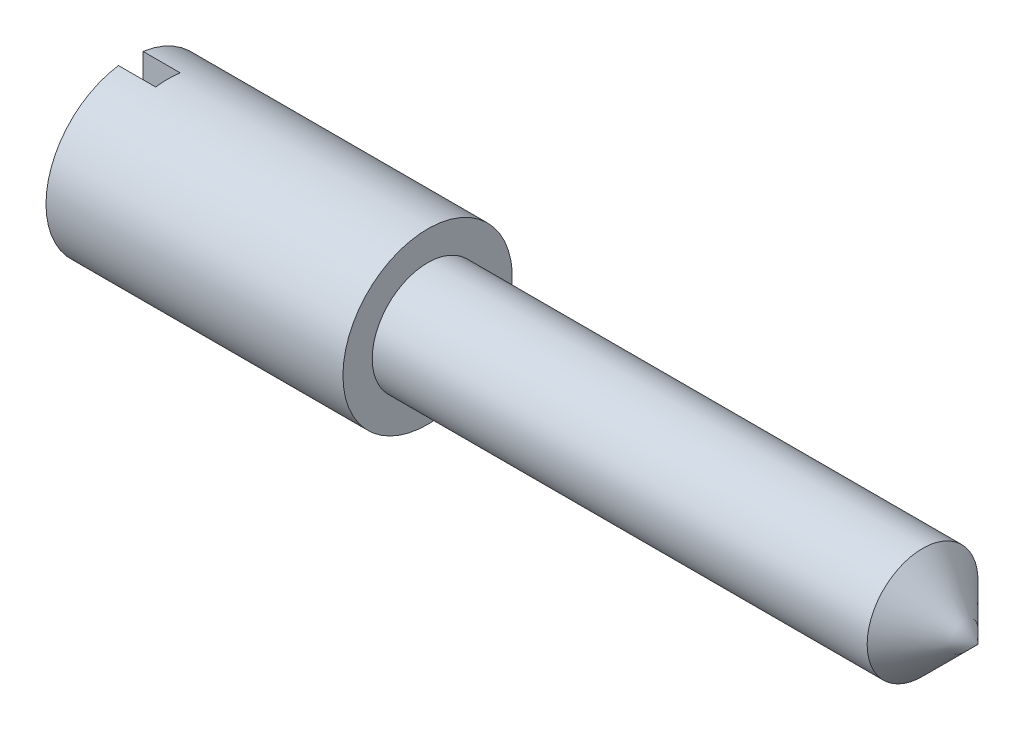
ISO-10303-21;
HEADER;
FILE_DESCRIPTION(('STEP AP214'),'2;1');
FILE_NAME('part.step','',(''),(''),'','','');
FILE_SCHEMA(('AUTOMOTIVE_DESIGN { 1 0 10303 214 1 1 1 1 }'));
ENDSEC;
DATA;
#1=APPLICATION_CONTEXT('core data for automotive mechanical design processes');
#2=APPLICATION_PROTOCOL_DEFINITION('international standard','automotive_design',2000,#1);
#3=PRODUCT_CONTEXT('',#1,'mechanical');
#4=PRODUCT('Part','Part','',(#3));
#5=PRODUCT_RELATED_PRODUCT_CATEGORY('part','',(#4));
#6=PRODUCT_DEFINITION_FORMATION('','',#4);
#7=PRODUCT_DEFINITION_CONTEXT('part definition',#1,'design');
#8=PRODUCT_DEFINITION('design','',#6,#7);
#9=PRODUCT_DEFINITION_SHAPE('','',#8);
#10=(LENGTH_UNIT() NAMED_UNIT(*) SI_UNIT(.MILLI.,.METRE.));
#11=(NAMED_UNIT(*) PLANE_ANGLE_UNIT() SI_UNIT($,.RADIAN.));
#12=(NAMED_UNIT(*) SI_UNIT($,.STERADIAN.) SOLID_ANGLE_UNIT());
#13=UNCERTAINTY_MEASURE_WITH_UNIT(LENGTH_MEASURE(1.E-05),#10,'distance_accuracy_value','');
#14=(GEOMETRIC_REPRESENTATION_CONTEXT(3) GLOBAL_UNCERTAINTY_ASSIGNED_CONTEXT((#13)) GLOBAL_UNIT_ASSIGNED_CONTEXT((#10,
#11,#12)) REPRESENTATION_CONTEXT('',''));
#15=CARTESIAN_POINT('',(0.,0.,0.));
#16=DIRECTION('',(0.,0.,1.));
#17=DIRECTION('',(1.,0.,0.));
#18=AXIS2_PLACEMENT_3D('',#15,#16,#17);
#19=CARTESIAN_POINT('',(-9.525,0.,-0.939799999999999));
#20=DIRECTION('',(1.,0.,0.));
#21=DIRECTION('',(0.,0.,-1.));
#22=AXIS2_PLACEMENT_3D('',#19,#20,#21);
#23=PLANE('',#22);
#24=CARTESIAN_POINT('',(-9.525,0.,1.778));
#25=DIRECTION('',(-1.,0.,0.));
#26=DIRECTION('',(0.,0.,1.));
#27=AXIS2_PLACEMENT_3D('',#24,#25,#26);
#28=CIRCLE('',#27,2.7178);
#29=CARTESIAN_POINT('',(-9.525,2.68913315958879,1.3843));
#30=VERTEX_POINT('',#29);
#31=CARTESIAN_POINT('',(-9.525,-2.68913315958879,1.3843));
#32=VERTEX_POINT('',#31);
#33=EDGE_CURVE('E109',#30,#32,#28,.T.);
#34=ORIENTED_EDGE('',*,*,#33,.T.);
#35=DIRECTION('',(0.,1.,0.));
#36=VECTOR('',#35,1.);
#37=CARTESIAN_POINT('',(-9.525,0.,1.3843));
#38=LINE('',#37,#36);
#39=EDGE_CURVE('E95',#32,#30,#38,.T.);
#40=ORIENTED_EDGE('',*,*,#39,.T.);
#41=EDGE_LOOP('',(#34,#40));
#42=FACE_BOUND('',#41,.T.);
#43=ADVANCED_FACE('F46',(#42),#23,.F.);
#44=CARTESIAN_POINT('',(0.,0.,0.));
#45=DIRECTION('',(-1.,0.,0.));
#46=DIRECTION('',(0.,0.,1.));
#47=AXIS2_PLACEMENT_3D('',#44,#45,#46);
#48=PLANE('',#47);
#49=CARTESIAN_POINT('',(0.,0.,1.778));
#50=DIRECTION('',(-1.,0.,0.));
#51=DIRECTION('',(0.,0.,1.));
#52=AXIS2_PLACEMENT_3D('',#49,#50,#51);
#53=CIRCLE('',#52,2.7178);
#54=CARTESIAN_POINT('',(0.,0.,4.4958));
#55=VERTEX_POINT('',#54);
#56=EDGE_CURVE('E96',#55,#55,#53,.T.);
#57=ORIENTED_EDGE('',*,*,#56,.F.);
#58=EDGE_LOOP('',(#57));
#59=FACE_BOUND('',#58,.T.);
#60=CARTESIAN_POINT('',(0.,0.,1.778));
#61=DIRECTION('',(-1.,0.,0.));
#62=DIRECTION('',(0.,0.,1.));
#63=AXIS2_PLACEMENT_3D('',#60,#61,#62);
#64=CIRCLE('',#63,1.778);
#65=CARTESIAN_POINT('',(0.,0.,3.556));
#66=VERTEX_POINT('',#65);
#67=EDGE_CURVE('E116',#66,#66,#64,.T.);
#68=ORIENTED_EDGE('',*,*,#67,.T.);
#69=EDGE_LOOP('',(#68));
#70=FACE_BOUND('',#69,.T.);
#71=ADVANCED_FACE('F48',(#59,#70),#48,.F.);
#72=CARTESIAN_POINT('',(-9.525,0.,1.778));
#73=DIRECTION('',(-1.,0.,0.));
#74=DIRECTION('',(0.,0.,1.));
#75=AXIS2_PLACEMENT_3D('',#72,#73,#74);
#76=CYLINDRICAL_SURFACE('',#75,2.7178);
#77=ORIENTED_EDGE('',*,*,#33,.F.);
#78=DIRECTION('',(-1.,0.,0.));
#79=VECTOR('',#78,1.);
#80=CARTESIAN_POINT('',(-9.525,2.68913315958879,1.3843));
#81=LINE('',#80,#79);
#82=CARTESIAN_POINT('',(-8.3312,2.68913315958879,1.3843));
#83=VERTEX_POINT('',#82);
#84=EDGE_CURVE('E105',#30,#83,#81,.F.);
#85=ORIENTED_EDGE('',*,*,#84,.T.);
#86=CARTESIAN_POINT('',(-8.3312,0.,1.778));
#87=DIRECTION('',(-1.,0.,0.));
#88=DIRECTION('',(0.,0.,1.));
#89=AXIS2_PLACEMENT_3D('',#86,#87,#88);
#90=CIRCLE('',#89,2.7178);
#91=CARTESIAN_POINT('',(-8.3312,2.68913315958879,2.1717));
#92=VERTEX_POINT('',#91);
#93=EDGE_CURVE('E12',#92,#83,#90,.T.);
#94=ORIENTED_EDGE('',*,*,#93,.F.);
#95=DIRECTION('',(-1.,0.,0.));
#96=VECTOR('',#95,1.);
#97=CARTESIAN_POINT('',(-9.525,2.68913315958879,2.1717));
#98=LINE('',#97,#96);
#99=CARTESIAN_POINT('',(-9.525,2.68913315958879,2.1717));
#100=VERTEX_POINT('',#99);
#101=EDGE_CURVE('E89',#92,#100,#98,.T.);
#102=ORIENTED_EDGE('',*,*,#101,.T.);
#103=CARTESIAN_POINT('',(-9.525,-2.68913315958879,2.1717));
#104=VERTEX_POINT('',#103);
#105=EDGE_CURVE('E102',#104,#100,#28,.T.);
#106=ORIENTED_EDGE('',*,*,#105,.F.);
#107=DIRECTION('',(-1.,0.,0.));
#108=VECTOR('',#107,1.);
#109=CARTESIAN_POINT('',(-9.525,-2.68913315958879,2.1717));
#110=LINE('',#109,#108);
#111=CARTESIAN_POINT('',(-8.3312,-2.68913315958879,2.1717));
#112=VERTEX_POINT('',#111);
#113=EDGE_CURVE('E62',#104,#112,#110,.F.);
#114=ORIENTED_EDGE('',*,*,#113,.T.);
#115=CARTESIAN_POINT('',(-8.3312,-2.68913315958879,1.3843));
#116=VERTEX_POINT('',#115);
#117=EDGE_CURVE('E50',#116,#112,#90,.T.);
#118=ORIENTED_EDGE('',*,*,#117,.F.);
#119=DIRECTION('',(-1.,0.,0.));
#120=VECTOR('',#119,1.);
#121=CARTESIAN_POINT('',(-9.525,-2.68913315958879,1.3843));
#122=LINE('',#121,#120);
#123=EDGE_CURVE('E142',#116,#32,#122,.T.);
#124=ORIENTED_EDGE('',*,*,#123,.T.);
#125=EDGE_LOOP('',(#77,#85,#94,#102,#106,#114,#118,#124));
#126=FACE_BOUND('',#125,.T.);
#127=ORIENTED_EDGE('',*,*,#56,.T.);
#128=EDGE_LOOP('',(#127));
#129=FACE_BOUND('',#128,.T.);
#130=ADVANCED_FACE('F100',(#126,#129),#76,.T.);
#131=ORIENTED_EDGE('',*,*,#105,.T.);
#132=DIRECTION('',(0.,-1.,0.));
#133=VECTOR('',#132,1.);
#134=CARTESIAN_POINT('',(-9.525,0.,2.1717));
#135=LINE('',#134,#133);
#136=EDGE_CURVE('E86',#100,#104,#135,.T.);
#137=ORIENTED_EDGE('',*,*,#136,.T.);
#138=EDGE_LOOP('',(#131,#137));
#139=FACE_BOUND('',#138,.T.);
#140=ADVANCED_FACE('F107',(#139),#23,.F.);
#141=CARTESIAN_POINT('',(17.653,0.,1.778));
#142=DIRECTION('',(-1.,0.,0.));
#143=DIRECTION('',(0.,0.,1.));
#144=AXIS2_PLACEMENT_3D('',#141,#142,#143);
#145=CONICAL_SURFACE('',#144,0.,0.785398163397448);
#146=CARTESIAN_POINT('',(15.875,0.,1.778));
#147=DIRECTION('',(-1.,0.,0.));
#148=DIRECTION('',(0.,0.,1.));
#149=AXIS2_PLACEMENT_3D('',#146,#147,#148);
#150=CIRCLE('',#149,1.778);
#151=CARTESIAN_POINT('',(15.875,0.,3.556));
#152=VERTEX_POINT('',#151);
#153=EDGE_CURVE('E110',#152,#152,#150,.T.);
#154=ORIENTED_EDGE('',*,*,#153,.F.);
#155=EDGE_LOOP('',(#154));
#156=FACE_BOUND('',#155,.T.);
#157=CARTESIAN_POINT('',(17.653,0.,1.778));
#158=VERTEX_POINT('',#157);
#159=VERTEX_LOOP('',#158);
#160=FACE_BOUND('',#159,.T.);
#161=ADVANCED_FACE('F152',(#156,#160),#145,.T.);
#162=CARTESIAN_POINT('',(-9.525,0.,1.778));
#163=DIRECTION('',(-1.,0.,0.));
#164=DIRECTION('',(0.,0.,1.));
#165=AXIS2_PLACEMENT_3D('',#162,#163,#164);
#166=CYLINDRICAL_SURFACE('',#165,1.778);
#167=ORIENTED_EDGE('',*,*,#67,.F.);
#168=EDGE_LOOP('',(#167));
#169=FACE_BOUND('',#168,.T.);
#170=ORIENTED_EDGE('',*,*,#153,.T.);
#171=EDGE_LOOP('',(#170));
#172=FACE_BOUND('',#171,.T.);
#173=ADVANCED_FACE('F149',(#169,#172),#166,.T.);
#174=CARTESIAN_POINT('',(-8.3312,0.,0.));
#175=DIRECTION('',(-1.,0.,0.));
#176=DIRECTION('',(0.,0.,1.));
#177=AXIS2_PLACEMENT_3D('',#174,#175,#176);
#178=PLANE('',#177);
#179=DIRECTION('',(0.,1.,0.));
#180=VECTOR('',#179,1.);
#181=CARTESIAN_POINT('',(-8.3312,-2.7178,2.1717));
#182=LINE('',#181,#180);
#183=EDGE_CURVE('E129',#112,#92,#182,.T.);
#184=ORIENTED_EDGE('',*,*,#183,.T.);
#185=ORIENTED_EDGE('',*,*,#93,.T.);
#186=DIRECTION('',(0.,-1.,0.));
#187=VECTOR('',#186,1.);
#188=CARTESIAN_POINT('',(-8.3312,2.7178,1.3843));
#189=LINE('',#188,#187);
#190=EDGE_CURVE('E131',#83,#116,#189,.T.);
#191=ORIENTED_EDGE('',*,*,#190,.T.);
#192=ORIENTED_EDGE('',*,*,#117,.T.);
#193=EDGE_LOOP('',(#184,#185,#191,#192));
#194=FACE_BOUND('',#193,.T.);
#195=ADVANCED_FACE('F128',(#194),#178,.T.);
#196=CARTESIAN_POINT('',(-8.3312,2.7178,1.3843));
#197=DIRECTION('',(0.,0.,-1.));
#198=DIRECTION('',(-1.,0.,0.));
#199=AXIS2_PLACEMENT_3D('',#196,#197,#198);
#200=PLANE('',#199);
#201=ORIENTED_EDGE('',*,*,#190,.F.);
#202=ORIENTED_EDGE('',*,*,#84,.F.);
#203=ORIENTED_EDGE('',*,*,#39,.F.);
#204=ORIENTED_EDGE('',*,*,#123,.F.);
#205=EDGE_LOOP('',(#201,#202,#203,#204));
#206=FACE_BOUND('',#205,.T.);
#207=ADVANCED_FACE('F183',(#206),#200,.F.);
#208=CARTESIAN_POINT('',(-8.3312,-2.7178,2.1717));
#209=DIRECTION('',(0.,0.,1.));
#210=DIRECTION('',(0.,-1.,0.));
#211=AXIS2_PLACEMENT_3D('',#208,#209,#210);
#212=PLANE('',#211);
#213=ORIENTED_EDGE('',*,*,#183,.F.);
#214=ORIENTED_EDGE('',*,*,#113,.F.);
#215=ORIENTED_EDGE('',*,*,#136,.F.);
#216=ORIENTED_EDGE('',*,*,#101,.F.);
#217=EDGE_LOOP('',(#213,#214,#215,#216));
#218=FACE_BOUND('',#217,.T.);
#219=ADVANCED_FACE('F88',(#218),#212,.F.);
#220=CLOSED_SHELL('',(#43,#71,#130,#140,#161,#173,#195,#207,#219));
#221=MANIFOLD_SOLID_BREP('B2',#220);
#222=ADVANCED_BREP_SHAPE_REPRESENTATION('',(#18,#221),#14);
#223=SHAPE_DEFINITION_REPRESENTATION(#9,#222);
ENDSEC;
END-ISO-10303-21;
